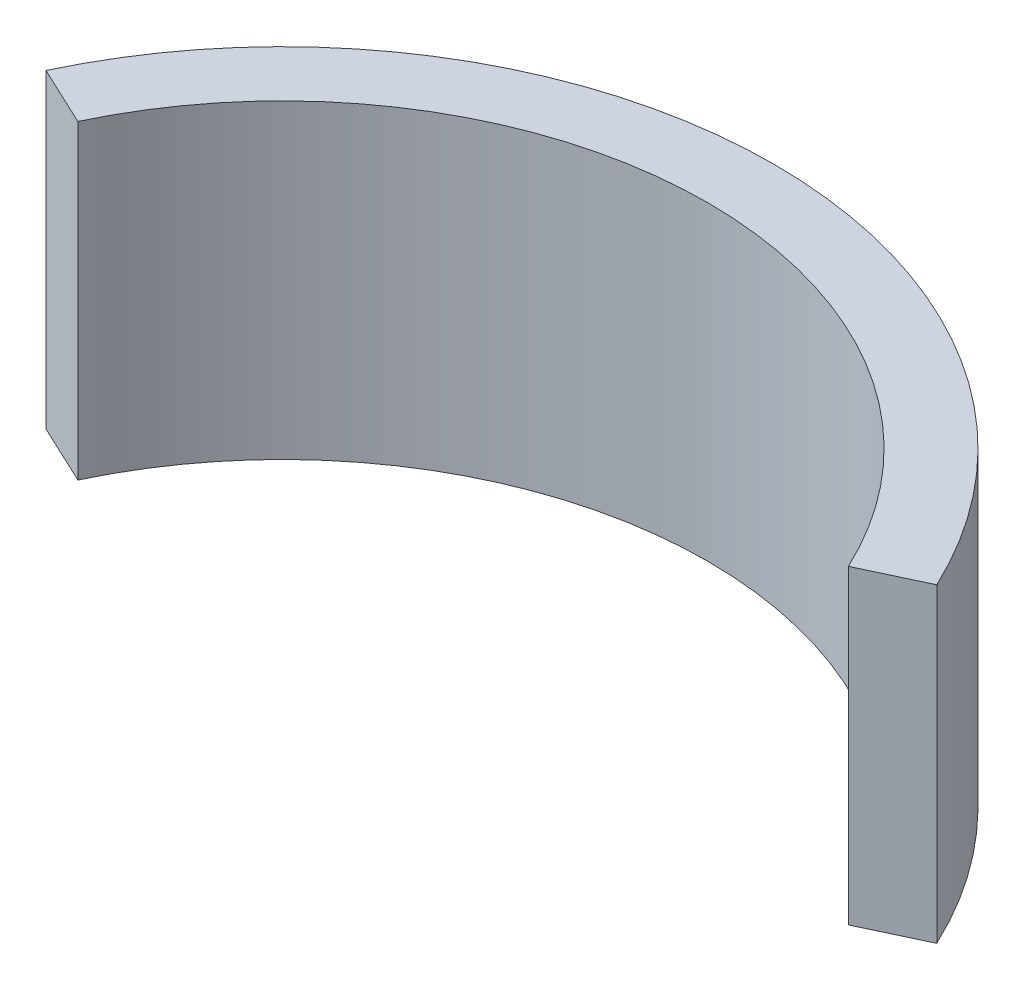
ISO-10303-21;
HEADER;
FILE_DESCRIPTION(('STEP AP214'),'2;1');
FILE_NAME('part.step','',(''),(''),'','','');
FILE_SCHEMA(('AUTOMOTIVE_DESIGN { 1 0 10303 214 1 1 1 1 }'));
ENDSEC;
DATA;
#1=APPLICATION_CONTEXT('core data for automotive mechanical design processes');
#2=APPLICATION_PROTOCOL_DEFINITION('international standard','automotive_design',2000,#1);
#3=PRODUCT_CONTEXT('',#1,'mechanical');
#4=PRODUCT('Part','Part','',(#3));
#5=PRODUCT_RELATED_PRODUCT_CATEGORY('part','',(#4));
#6=PRODUCT_DEFINITION_FORMATION('','',#4);
#7=PRODUCT_DEFINITION_CONTEXT('part definition',#1,'design');
#8=PRODUCT_DEFINITION('design','',#6,#7);
#9=PRODUCT_DEFINITION_SHAPE('','',#8);
#10=(LENGTH_UNIT() NAMED_UNIT(*) SI_UNIT(.MILLI.,.METRE.));
#11=(NAMED_UNIT(*) PLANE_ANGLE_UNIT() SI_UNIT($,.RADIAN.));
#12=(NAMED_UNIT(*) SI_UNIT($,.STERADIAN.) SOLID_ANGLE_UNIT());
#13=UNCERTAINTY_MEASURE_WITH_UNIT(LENGTH_MEASURE(1.E-05),#10,'distance_accuracy_value','');
#14=(GEOMETRIC_REPRESENTATION_CONTEXT(3) GLOBAL_UNCERTAINTY_ASSIGNED_CONTEXT((#13)) GLOBAL_UNIT_ASSIGNED_CONTEXT((#10,
#11,#12)) REPRESENTATION_CONTEXT('',''));
#15=CARTESIAN_POINT('',(0.,0.,0.));
#16=DIRECTION('',(0.,0.,1.));
#17=DIRECTION('',(1.,0.,0.));
#18=AXIS2_PLACEMENT_3D('',#15,#16,#17);
#19=CARTESIAN_POINT('',(0.,6.08,9.635));
#20=DIRECTION('',(0.,-1.,0.));
#21=DIRECTION('',(0.,0.,-1.));
#22=AXIS2_PLACEMENT_3D('',#19,#20,#21);
#23=CYLINDRICAL_SURFACE('',#22,8.335);
#24=CARTESIAN_POINT('',(0.,0.,9.635));
#25=DIRECTION('',(0.,-1.,0.));
#26=DIRECTION('',(0.,0.,1.));
#27=AXIS2_PLACEMENT_3D('',#24,#25,#26);
#28=CIRCLE('',#27,8.335);
#29=CARTESIAN_POINT('',(-7.54328125116341,0.,6.08942064454249));
#30=VERTEX_POINT('',#29);
#31=CARTESIAN_POINT('',(7.54328125116342,0.,6.08942064454249));
#32=VERTEX_POINT('',#31);
#33=EDGE_CURVE('E98',#30,#32,#28,.T.);
#34=ORIENTED_EDGE('',*,*,#33,.T.);
#35=DIRECTION('',(0.,-1.,0.));
#36=VECTOR('',#35,1.);
#37=CARTESIAN_POINT('',(7.54328125116342,6.08,6.08942064454249));
#38=LINE('',#37,#36);
#39=CARTESIAN_POINT('',(7.54328125116342,6.08,6.08942064454249));
#40=VERTEX_POINT('',#39);
#41=EDGE_CURVE('E11',#40,#32,#38,.T.);
#42=ORIENTED_EDGE('',*,*,#41,.F.);
#43=CARTESIAN_POINT('',(0.,6.08,9.635));
#44=DIRECTION('',(0.,-1.,0.));
#45=DIRECTION('',(0.,0.,1.));
#46=AXIS2_PLACEMENT_3D('',#43,#44,#45);
#47=CIRCLE('',#46,8.335);
#48=CARTESIAN_POINT('',(-7.54328125116341,6.08,6.08942064454249));
#49=VERTEX_POINT('',#48);
#50=EDGE_CURVE('E86',#49,#40,#47,.T.);
#51=ORIENTED_EDGE('',*,*,#50,.F.);
#52=DIRECTION('',(0.,-1.,0.));
#53=VECTOR('',#52,1.);
#54=CARTESIAN_POINT('',(-7.54328125116341,6.08,6.08942064454249));
#55=LINE('',#54,#53);
#56=EDGE_CURVE('E94',#49,#30,#55,.T.);
#57=ORIENTED_EDGE('',*,*,#56,.T.);
#58=EDGE_LOOP('',(#34,#42,#51,#57));
#59=FACE_BOUND('',#58,.T.);
#60=ADVANCED_FACE('F35',(#59),#23,.F.);
#61=CARTESIAN_POINT('',(7.54328125116342,6.08,6.08942064454249));
#62=DIRECTION('',(-0.425384445765749,0.,-0.905012747590092));
#63=DIRECTION('',(-0.905012747590092,0.,0.425384445765749));
#64=AXIS2_PLACEMENT_3D('',#61,#62,#63);
#65=PLANE('',#64);
#66=DIRECTION('',(0.905012747590092,0.,-0.425384445765749));
#67=VECTOR('',#66,1.);
#68=CARTESIAN_POINT('',(7.54328125116342,0.,6.08942064454249));
#69=LINE('',#68,#67);
#70=CARTESIAN_POINT('',(8.71979782303054,0.,5.53642086504702));
#71=VERTEX_POINT('',#70);
#72=EDGE_CURVE('E90',#32,#71,#69,.T.);
#73=ORIENTED_EDGE('',*,*,#72,.T.);
#74=DIRECTION('',(0.,-1.,0.));
#75=VECTOR('',#74,1.);
#76=CARTESIAN_POINT('',(8.71979782303054,6.08,5.53642086504702));
#77=LINE('',#76,#75);
#78=CARTESIAN_POINT('',(8.71979782303054,6.08,5.53642086504702));
#79=VERTEX_POINT('',#78);
#80=EDGE_CURVE('E43',#79,#71,#77,.T.);
#81=ORIENTED_EDGE('',*,*,#80,.F.);
#82=DIRECTION('',(0.905012747590092,0.,-0.425384445765749));
#83=VECTOR('',#82,1.);
#84=CARTESIAN_POINT('',(7.54328125116342,6.08,6.08942064454249));
#85=LINE('',#84,#83);
#86=EDGE_CURVE('E81',#40,#79,#85,.T.);
#87=ORIENTED_EDGE('',*,*,#86,.F.);
#88=ORIENTED_EDGE('',*,*,#41,.T.);
#89=EDGE_LOOP('',(#73,#81,#87,#88));
#90=FACE_BOUND('',#89,.T.);
#91=ADVANCED_FACE('F89',(#90),#65,.F.);
#92=CARTESIAN_POINT('',(0.,6.08,9.635));
#93=DIRECTION('',(0.,-1.,0.));
#94=DIRECTION('',(0.,0.,-1.));
#95=AXIS2_PLACEMENT_3D('',#92,#93,#94);
#96=CYLINDRICAL_SURFACE('',#95,9.635);
#97=CARTESIAN_POINT('',(0.,0.,9.635));
#98=DIRECTION('',(0.,1.,0.));
#99=DIRECTION('',(0.,0.,1.));
#100=AXIS2_PLACEMENT_3D('',#97,#98,#99);
#101=CIRCLE('',#100,9.635);
#102=CARTESIAN_POINT('',(-8.71979782303054,0.,5.53642086504702));
#103=VERTEX_POINT('',#102);
#104=EDGE_CURVE('E68',#71,#103,#101,.T.);
#105=ORIENTED_EDGE('',*,*,#104,.T.);
#106=DIRECTION('',(0.,-1.,0.));
#107=VECTOR('',#106,1.);
#108=CARTESIAN_POINT('',(-8.71979782303054,6.08,5.53642086504702));
#109=LINE('',#108,#107);
#110=CARTESIAN_POINT('',(-8.71979782303054,6.08,5.53642086504702));
#111=VERTEX_POINT('',#110);
#112=EDGE_CURVE('E91',#111,#103,#109,.T.);
#113=ORIENTED_EDGE('',*,*,#112,.F.);
#114=CARTESIAN_POINT('',(0.,6.08,9.635));
#115=DIRECTION('',(0.,1.,0.));
#116=DIRECTION('',(0.,0.,1.));
#117=AXIS2_PLACEMENT_3D('',#114,#115,#116);
#118=CIRCLE('',#117,9.635);
#119=EDGE_CURVE('E84',#79,#111,#118,.T.);
#120=ORIENTED_EDGE('',*,*,#119,.F.);
#121=ORIENTED_EDGE('',*,*,#80,.T.);
#122=EDGE_LOOP('',(#105,#113,#120,#121));
#123=FACE_BOUND('',#122,.T.);
#124=ADVANCED_FACE('F92',(#123),#96,.T.);
#125=CARTESIAN_POINT('',(-8.71979782303054,6.08,5.53642086504701));
#126=DIRECTION('',(0.425384445765749,0.,-0.905012747590091));
#127=DIRECTION('',(-0.905012747590091,0.,-0.425384445765749));
#128=AXIS2_PLACEMENT_3D('',#125,#126,#127);
#129=PLANE('',#128);
#130=DIRECTION('',(0.905012747590091,0.,0.425384445765749));
#131=VECTOR('',#130,1.);
#132=CARTESIAN_POINT('',(-8.71979782303054,0.,5.53642086504701));
#133=LINE('',#132,#131);
#134=EDGE_CURVE('E74',#103,#30,#133,.T.);
#135=ORIENTED_EDGE('',*,*,#134,.T.);
#136=ORIENTED_EDGE('',*,*,#56,.F.);
#137=DIRECTION('',(0.905012747590091,0.,0.425384445765749));
#138=VECTOR('',#137,1.);
#139=CARTESIAN_POINT('',(-8.71979782303054,6.08,5.53642086504701));
#140=LINE('',#139,#138);
#141=EDGE_CURVE('E51',#111,#49,#140,.T.);
#142=ORIENTED_EDGE('',*,*,#141,.F.);
#143=ORIENTED_EDGE('',*,*,#112,.T.);
#144=EDGE_LOOP('',(#135,#136,#142,#143));
#145=FACE_BOUND('',#144,.T.);
#146=ADVANCED_FACE('F105',(#145),#129,.F.);
#147=CARTESIAN_POINT('',(0.,6.08,9.635));
#148=DIRECTION('',(0.,1.,0.));
#149=DIRECTION('',(0.,0.,1.));
#150=AXIS2_PLACEMENT_3D('',#147,#148,#149);
#151=PLANE('',#150);
#152=ORIENTED_EDGE('',*,*,#50,.T.);
#153=ORIENTED_EDGE('',*,*,#86,.T.);
#154=ORIENTED_EDGE('',*,*,#119,.T.);
#155=ORIENTED_EDGE('',*,*,#141,.T.);
#156=EDGE_LOOP('',(#152,#153,#154,#155));
#157=FACE_BOUND('',#156,.T.);
#158=ADVANCED_FACE('F82',(#157),#151,.T.);
#159=CARTESIAN_POINT('',(0.,0.,9.635));
#160=DIRECTION('',(0.,1.,0.));
#161=DIRECTION('',(0.,0.,1.));
#162=AXIS2_PLACEMENT_3D('',#159,#160,#161);
#163=PLANE('',#162);
#164=ORIENTED_EDGE('',*,*,#33,.F.);
#165=ORIENTED_EDGE('',*,*,#134,.F.);
#166=ORIENTED_EDGE('',*,*,#104,.F.);
#167=ORIENTED_EDGE('',*,*,#72,.F.);
#168=EDGE_LOOP('',(#164,#165,#166,#167));
#169=FACE_BOUND('',#168,.T.);
#170=ADVANCED_FACE('F108',(#169),#163,.F.);
#171=CLOSED_SHELL('',(#60,#91,#124,#146,#158,#170));
#172=MANIFOLD_SOLID_BREP('B2',#171);
#173=ADVANCED_BREP_SHAPE_REPRESENTATION('',(#18,#172),#14);
#174=SHAPE_DEFINITION_REPRESENTATION(#9,#173);
ENDSEC;
END-ISO-10303-21;
